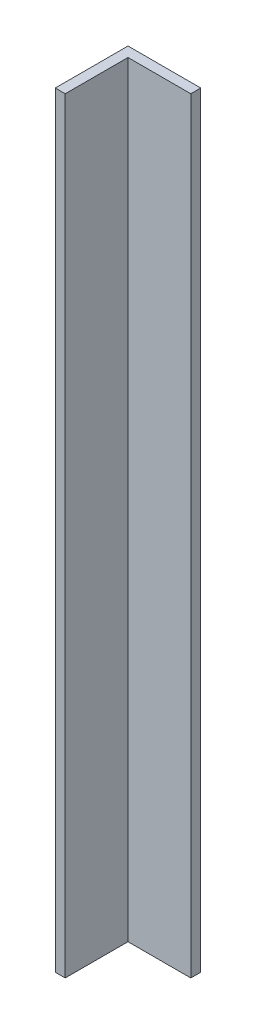
ISO-10303-21;
HEADER;
FILE_DESCRIPTION(('STEP AP214'),'2;1');
FILE_NAME('part.step','',(''),(''),'','','');
FILE_SCHEMA(('AUTOMOTIVE_DESIGN { 1 0 10303 214 1 1 1 1 }'));
ENDSEC;
DATA;
#1=APPLICATION_CONTEXT('core data for automotive mechanical design processes');
#2=APPLICATION_PROTOCOL_DEFINITION('international standard','automotive_design',2000,#1);
#3=PRODUCT_CONTEXT('',#1,'mechanical');
#4=PRODUCT('Part','Part','',(#3));
#5=PRODUCT_RELATED_PRODUCT_CATEGORY('part','',(#4));
#6=PRODUCT_DEFINITION_FORMATION('','',#4);
#7=PRODUCT_DEFINITION_CONTEXT('part definition',#1,'design');
#8=PRODUCT_DEFINITION('design','',#6,#7);
#9=PRODUCT_DEFINITION_SHAPE('','',#8);
#10=(LENGTH_UNIT() NAMED_UNIT(*) SI_UNIT(.MILLI.,.METRE.));
#11=(NAMED_UNIT(*) PLANE_ANGLE_UNIT() SI_UNIT($,.RADIAN.));
#12=(NAMED_UNIT(*) SI_UNIT($,.STERADIAN.) SOLID_ANGLE_UNIT());
#13=UNCERTAINTY_MEASURE_WITH_UNIT(LENGTH_MEASURE(1.E-05),#10,'distance_accuracy_value','');
#14=(GEOMETRIC_REPRESENTATION_CONTEXT(3) GLOBAL_UNCERTAINTY_ASSIGNED_CONTEXT((#13)) GLOBAL_UNIT_ASSIGNED_CONTEXT((#10,
#11,#12)) REPRESENTATION_CONTEXT('',''));
#15=CARTESIAN_POINT('',(0.,0.,0.));
#16=DIRECTION('',(0.,0.,1.));
#17=DIRECTION('',(1.,0.,0.));
#18=AXIS2_PLACEMENT_3D('',#15,#16,#17);
#19=CARTESIAN_POINT('',(0.,200.,16.4));
#20=DIRECTION('',(-1.,0.,0.));
#21=DIRECTION('',(0.,0.,1.));
#22=AXIS2_PLACEMENT_3D('',#19,#20,#21);
#23=PLANE('',#22);
#24=DIRECTION('',(0.,0.,-1.));
#25=VECTOR('',#24,1.);
#26=CARTESIAN_POINT('',(0.,0.,16.4));
#27=LINE('',#26,#25);
#28=CARTESIAN_POINT('',(0.,0.,16.4));
#29=VERTEX_POINT('',#28);
#30=CARTESIAN_POINT('',(0.,0.,0.));
#31=VERTEX_POINT('',#30);
#32=EDGE_CURVE('E117',#29,#31,#27,.T.);
#33=ORIENTED_EDGE('',*,*,#32,.T.);
#34=DIRECTION('',(0.,-1.,0.));
#35=VECTOR('',#34,1.);
#36=CARTESIAN_POINT('',(0.,200.,0.));
#37=LINE('',#36,#35);
#38=CARTESIAN_POINT('',(0.,200.,0.));
#39=VERTEX_POINT('',#38);
#40=EDGE_CURVE('E11',#39,#31,#37,.T.);
#41=ORIENTED_EDGE('',*,*,#40,.F.);
#42=DIRECTION('',(0.,0.,-1.));
#43=VECTOR('',#42,1.);
#44=CARTESIAN_POINT('',(0.,200.,16.4));
#45=LINE('',#44,#43);
#46=CARTESIAN_POINT('',(0.,200.,16.4));
#47=VERTEX_POINT('',#46);
#48=EDGE_CURVE('E127',#47,#39,#45,.T.);
#49=ORIENTED_EDGE('',*,*,#48,.F.);
#50=DIRECTION('',(0.,-1.,0.));
#51=VECTOR('',#50,1.);
#52=CARTESIAN_POINT('',(0.,200.,16.4));
#53=LINE('',#52,#51);
#54=EDGE_CURVE('E113',#47,#29,#53,.T.);
#55=ORIENTED_EDGE('',*,*,#54,.T.);
#56=EDGE_LOOP('',(#33,#41,#49,#55));
#57=FACE_BOUND('',#56,.T.);
#58=ADVANCED_FACE('F33',(#57),#23,.F.);
#59=CARTESIAN_POINT('',(0.,200.,0.));
#60=DIRECTION('',(0.,0.,-1.));
#61=DIRECTION('',(-1.,0.,0.));
#62=AXIS2_PLACEMENT_3D('',#59,#60,#61);
#63=PLANE('',#62);
#64=DIRECTION('',(1.,0.,0.));
#65=VECTOR('',#64,1.);
#66=CARTESIAN_POINT('',(0.,0.,0.));
#67=LINE('',#66,#65);
#68=CARTESIAN_POINT('',(16.4,0.,0.));
#69=VERTEX_POINT('',#68);
#70=EDGE_CURVE('E120',#31,#69,#67,.T.);
#71=ORIENTED_EDGE('',*,*,#70,.T.);
#72=DIRECTION('',(0.,-1.,0.));
#73=VECTOR('',#72,1.);
#74=CARTESIAN_POINT('',(16.4,200.,0.));
#75=LINE('',#74,#73);
#76=CARTESIAN_POINT('',(16.4,200.,0.));
#77=VERTEX_POINT('',#76);
#78=EDGE_CURVE('E41',#77,#69,#75,.T.);
#79=ORIENTED_EDGE('',*,*,#78,.F.);
#80=DIRECTION('',(1.,0.,0.));
#81=VECTOR('',#80,1.);
#82=CARTESIAN_POINT('',(0.,200.,0.));
#83=LINE('',#82,#81);
#84=EDGE_CURVE('E86',#39,#77,#83,.T.);
#85=ORIENTED_EDGE('',*,*,#84,.F.);
#86=ORIENTED_EDGE('',*,*,#40,.T.);
#87=EDGE_LOOP('',(#71,#79,#85,#86));
#88=FACE_BOUND('',#87,.T.);
#89=ADVANCED_FACE('F151',(#88),#63,.F.);
#90=CARTESIAN_POINT('',(16.4,200.,0.));
#91=DIRECTION('',(-1.,0.,0.));
#92=DIRECTION('',(0.,0.,1.));
#93=AXIS2_PLACEMENT_3D('',#90,#91,#92);
#94=PLANE('',#93);
#95=DIRECTION('',(0.,0.,-1.));
#96=VECTOR('',#95,1.);
#97=CARTESIAN_POINT('',(16.4,0.,0.));
#98=LINE('',#97,#96);
#99=CARTESIAN_POINT('',(16.4,0.,-2.6));
#100=VERTEX_POINT('',#99);
#101=EDGE_CURVE('E122',#69,#100,#98,.T.);
#102=ORIENTED_EDGE('',*,*,#101,.T.);
#103=DIRECTION('',(0.,-1.,0.));
#104=VECTOR('',#103,1.);
#105=CARTESIAN_POINT('',(16.4,200.,-2.6));
#106=LINE('',#105,#104);
#107=CARTESIAN_POINT('',(16.4,200.,-2.6));
#108=VERTEX_POINT('',#107);
#109=EDGE_CURVE('E108',#108,#100,#106,.T.);
#110=ORIENTED_EDGE('',*,*,#109,.F.);
#111=DIRECTION('',(0.,0.,-1.));
#112=VECTOR('',#111,1.);
#113=CARTESIAN_POINT('',(16.4,200.,0.));
#114=LINE('',#113,#112);
#115=EDGE_CURVE('E99',#77,#108,#114,.T.);
#116=ORIENTED_EDGE('',*,*,#115,.F.);
#117=ORIENTED_EDGE('',*,*,#78,.T.);
#118=EDGE_LOOP('',(#102,#110,#116,#117));
#119=FACE_BOUND('',#118,.T.);
#120=ADVANCED_FACE('F133',(#119),#94,.F.);
#121=CARTESIAN_POINT('',(16.4,200.,-2.6));
#122=DIRECTION('',(0.,0.,1.));
#123=DIRECTION('',(1.,0.,0.));
#124=AXIS2_PLACEMENT_3D('',#121,#122,#123);
#125=PLANE('',#124);
#126=DIRECTION('',(-1.,0.,0.));
#127=VECTOR('',#126,1.);
#128=CARTESIAN_POINT('',(16.4,0.,-2.6));
#129=LINE('',#128,#127);
#130=CARTESIAN_POINT('',(-2.6,0.,-2.6));
#131=VERTEX_POINT('',#130);
#132=EDGE_CURVE('E107',#100,#131,#129,.T.);
#133=ORIENTED_EDGE('',*,*,#132,.T.);
#134=DIRECTION('',(0.,-1.,0.));
#135=VECTOR('',#134,1.);
#136=CARTESIAN_POINT('',(-2.6,200.,-2.6));
#137=LINE('',#136,#135);
#138=CARTESIAN_POINT('',(-2.6,200.,-2.6));
#139=VERTEX_POINT('',#138);
#140=EDGE_CURVE('E104',#139,#131,#137,.T.);
#141=ORIENTED_EDGE('',*,*,#140,.F.);
#142=DIRECTION('',(-1.,0.,0.));
#143=VECTOR('',#142,1.);
#144=CARTESIAN_POINT('',(16.4,200.,-2.6));
#145=LINE('',#144,#143);
#146=EDGE_CURVE('E93',#108,#139,#145,.T.);
#147=ORIENTED_EDGE('',*,*,#146,.F.);
#148=ORIENTED_EDGE('',*,*,#109,.T.);
#149=EDGE_LOOP('',(#133,#141,#147,#148));
#150=FACE_BOUND('',#149,.T.);
#151=ADVANCED_FACE('F105',(#150),#125,.F.);
#152=CARTESIAN_POINT('',(-2.6,200.,-2.6));
#153=DIRECTION('',(1.,0.,0.));
#154=DIRECTION('',(0.,0.,-1.));
#155=AXIS2_PLACEMENT_3D('',#152,#153,#154);
#156=PLANE('',#155);
#157=DIRECTION('',(0.,0.,1.));
#158=VECTOR('',#157,1.);
#159=CARTESIAN_POINT('',(-2.6,0.,-2.6));
#160=LINE('',#159,#158);
#161=CARTESIAN_POINT('',(-2.6,0.,16.4));
#162=VERTEX_POINT('',#161);
#163=EDGE_CURVE('E72',#131,#162,#160,.T.);
#164=ORIENTED_EDGE('',*,*,#163,.T.);
#165=DIRECTION('',(0.,-1.,0.));
#166=VECTOR('',#165,1.);
#167=CARTESIAN_POINT('',(-2.6,200.,16.4));
#168=LINE('',#167,#166);
#169=CARTESIAN_POINT('',(-2.6,200.,16.4));
#170=VERTEX_POINT('',#169);
#171=EDGE_CURVE('E109',#170,#162,#168,.T.);
#172=ORIENTED_EDGE('',*,*,#171,.F.);
#173=DIRECTION('',(0.,0.,1.));
#174=VECTOR('',#173,1.);
#175=CARTESIAN_POINT('',(-2.6,200.,-2.6));
#176=LINE('',#175,#174);
#177=EDGE_CURVE('E97',#139,#170,#176,.T.);
#178=ORIENTED_EDGE('',*,*,#177,.F.);
#179=ORIENTED_EDGE('',*,*,#140,.T.);
#180=EDGE_LOOP('',(#164,#172,#178,#179));
#181=FACE_BOUND('',#180,.T.);
#182=ADVANCED_FACE('F111',(#181),#156,.F.);
#183=CARTESIAN_POINT('',(-2.6,200.,16.4));
#184=DIRECTION('',(0.,0.,-1.));
#185=DIRECTION('',(-1.,0.,0.));
#186=AXIS2_PLACEMENT_3D('',#183,#184,#185);
#187=PLANE('',#186);
#188=DIRECTION('',(1.,0.,0.));
#189=VECTOR('',#188,1.);
#190=CARTESIAN_POINT('',(-2.6,0.,16.4));
#191=LINE('',#190,#189);
#192=EDGE_CURVE('E78',#162,#29,#191,.T.);
#193=ORIENTED_EDGE('',*,*,#192,.T.);
#194=ORIENTED_EDGE('',*,*,#54,.F.);
#195=DIRECTION('',(1.,0.,0.));
#196=VECTOR('',#195,1.);
#197=CARTESIAN_POINT('',(-2.6,200.,16.4));
#198=LINE('',#197,#196);
#199=EDGE_CURVE('E49',#170,#47,#198,.T.);
#200=ORIENTED_EDGE('',*,*,#199,.F.);
#201=ORIENTED_EDGE('',*,*,#171,.T.);
#202=EDGE_LOOP('',(#193,#194,#200,#201));
#203=FACE_BOUND('',#202,.T.);
#204=ADVANCED_FACE('F140',(#203),#187,.F.);
#205=CARTESIAN_POINT('',(0.,200.,0.));
#206=DIRECTION('',(0.,-1.,0.));
#207=DIRECTION('',(0.,0.,-1.));
#208=AXIS2_PLACEMENT_3D('',#205,#206,#207);
#209=PLANE('',#208);
#210=ORIENTED_EDGE('',*,*,#48,.T.);
#211=ORIENTED_EDGE('',*,*,#84,.T.);
#212=ORIENTED_EDGE('',*,*,#115,.T.);
#213=ORIENTED_EDGE('',*,*,#146,.T.);
#214=ORIENTED_EDGE('',*,*,#177,.T.);
#215=ORIENTED_EDGE('',*,*,#199,.T.);
#216=EDGE_LOOP('',(#210,#211,#212,#213,#214,#215));
#217=FACE_BOUND('',#216,.T.);
#218=ADVANCED_FACE('F95',(#217),#209,.F.);
#219=CARTESIAN_POINT('',(0.,0.,0.));
#220=DIRECTION('',(0.,-1.,0.));
#221=DIRECTION('',(0.,0.,-1.));
#222=AXIS2_PLACEMENT_3D('',#219,#220,#221);
#223=PLANE('',#222);
#224=ORIENTED_EDGE('',*,*,#32,.F.);
#225=ORIENTED_EDGE('',*,*,#192,.F.);
#226=ORIENTED_EDGE('',*,*,#163,.F.);
#227=ORIENTED_EDGE('',*,*,#132,.F.);
#228=ORIENTED_EDGE('',*,*,#101,.F.);
#229=ORIENTED_EDGE('',*,*,#70,.F.);
#230=EDGE_LOOP('',(#224,#225,#226,#227,#228,#229));
#231=FACE_BOUND('',#230,.T.);
#232=ADVANCED_FACE('F136',(#231),#223,.T.);
#233=CLOSED_SHELL('',(#58,#89,#120,#151,#182,#204,#218,#232));
#234=MANIFOLD_SOLID_BREP('B2',#233);
#235=ADVANCED_BREP_SHAPE_REPRESENTATION('',(#18,#234),#14);
#236=SHAPE_DEFINITION_REPRESENTATION(#9,#235);
ENDSEC;
END-ISO-10303-21;
